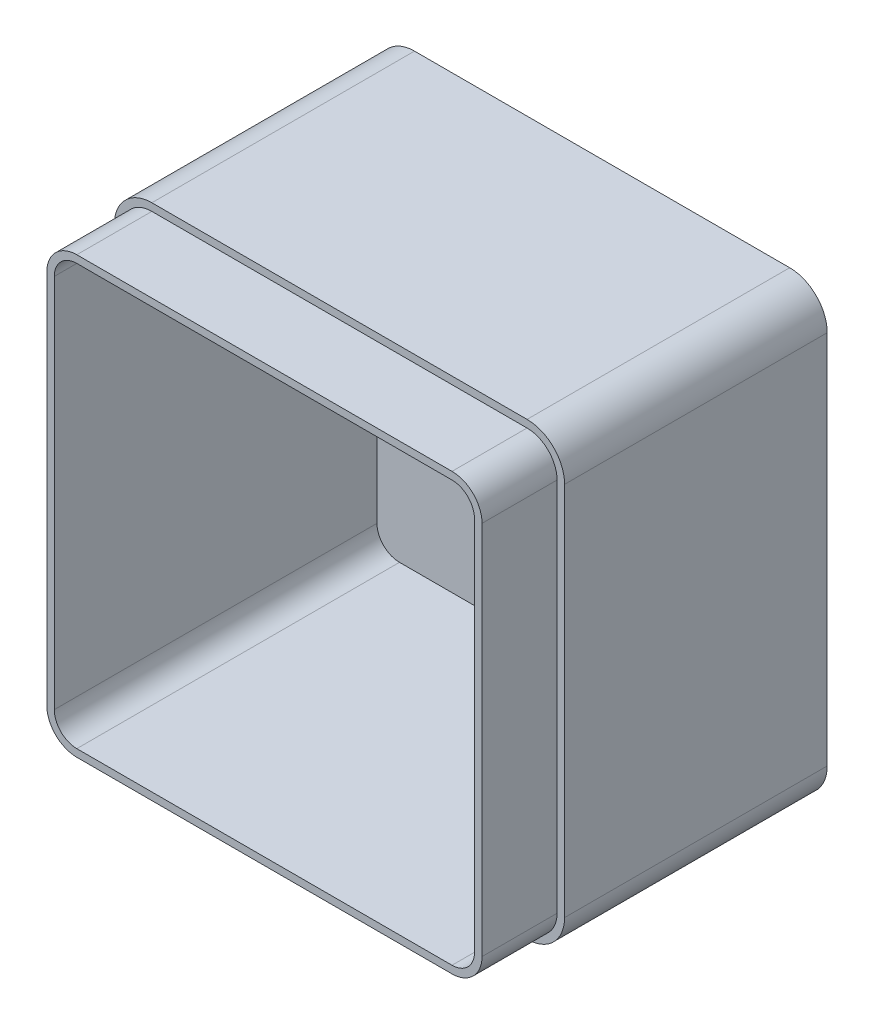
ISO-10303-21;
HEADER;
FILE_DESCRIPTION(('STEP AP214'),'2;1');
FILE_NAME('part.step','',(''),(''),'','','');
FILE_SCHEMA(('AUTOMOTIVE_DESIGN { 1 0 10303 214 1 1 1 1 }'));
ENDSEC;
DATA;
#1=APPLICATION_CONTEXT('core data for automotive mechanical design processes');
#2=APPLICATION_PROTOCOL_DEFINITION('international standard','automotive_design',2000,#1);
#3=PRODUCT_CONTEXT('',#1,'mechanical');
#4=PRODUCT('Part','Part','',(#3));
#5=PRODUCT_RELATED_PRODUCT_CATEGORY('part','',(#4));
#6=PRODUCT_DEFINITION_FORMATION('','',#4);
#7=PRODUCT_DEFINITION_CONTEXT('part definition',#1,'design');
#8=PRODUCT_DEFINITION('design','',#6,#7);
#9=PRODUCT_DEFINITION_SHAPE('','',#8);
#10=(LENGTH_UNIT() NAMED_UNIT(*) SI_UNIT(.MILLI.,.METRE.));
#11=(NAMED_UNIT(*) PLANE_ANGLE_UNIT() SI_UNIT($,.RADIAN.));
#12=(NAMED_UNIT(*) SI_UNIT($,.STERADIAN.) SOLID_ANGLE_UNIT());
#13=UNCERTAINTY_MEASURE_WITH_UNIT(LENGTH_MEASURE(1.E-05),#10,'distance_accuracy_value','');
#14=(GEOMETRIC_REPRESENTATION_CONTEXT(3) GLOBAL_UNCERTAINTY_ASSIGNED_CONTEXT((#13)) GLOBAL_UNIT_ASSIGNED_CONTEXT((#10,
#11,#12)) REPRESENTATION_CONTEXT('',''));
#15=CARTESIAN_POINT('',(0.,0.,0.));
#16=DIRECTION('',(0.,0.,1.));
#17=DIRECTION('',(1.,0.,0.));
#18=AXIS2_PLACEMENT_3D('',#15,#16,#17);
#19=CARTESIAN_POINT('',(0.,0.,90.));
#20=DIRECTION('',(0.,0.,-1.));
#21=DIRECTION('',(-1.,0.,0.));
#22=AXIS2_PLACEMENT_3D('',#19,#20,#21);
#23=PLANE('',#22);
#24=DIRECTION('',(1.,0.,0.));
#25=VECTOR('',#24,1.);
#26=CARTESIAN_POINT('',(0.,4.,90.));
#27=LINE('',#26,#25);
#28=CARTESIAN_POINT('',(9.99999999999999,4.,90.));
#29=VERTEX_POINT('',#28);
#30=CARTESIAN_POINT('',(110.,4.,90.));
#31=VERTEX_POINT('',#30);
#32=EDGE_CURVE('E330',#29,#31,#27,.T.);
#33=ORIENTED_EDGE('',*,*,#32,.F.);
#34=CARTESIAN_POINT('',(10.,10.,90.));
#35=DIRECTION('',(0.,0.,-1.));
#36=DIRECTION('',(-1.,0.,0.));
#37=AXIS2_PLACEMENT_3D('',#34,#35,#36);
#38=CIRCLE('',#37,6.);
#39=CARTESIAN_POINT('',(4.,9.99999999999999,90.));
#40=VERTEX_POINT('',#39);
#41=EDGE_CURVE('E331',#40,#29,#38,.F.);
#42=ORIENTED_EDGE('',*,*,#41,.F.);
#43=DIRECTION('',(0.,-1.,0.));
#44=VECTOR('',#43,1.);
#45=CARTESIAN_POINT('',(4.,0.,90.));
#46=LINE('',#45,#44);
#47=CARTESIAN_POINT('',(4.,110.,90.));
#48=VERTEX_POINT('',#47);
#49=EDGE_CURVE('E311',#48,#40,#46,.T.);
#50=ORIENTED_EDGE('',*,*,#49,.F.);
#51=CARTESIAN_POINT('',(10.,110.,90.));
#52=DIRECTION('',(0.,0.,-1.));
#53=DIRECTION('',(-1.,0.,0.));
#54=AXIS2_PLACEMENT_3D('',#51,#52,#53);
#55=CIRCLE('',#54,6.);
#56=CARTESIAN_POINT('',(9.99999999999999,116.,90.));
#57=VERTEX_POINT('',#56);
#58=EDGE_CURVE('E333',#57,#48,#55,.F.);
#59=ORIENTED_EDGE('',*,*,#58,.F.);
#60=DIRECTION('',(-1.,0.,0.));
#61=VECTOR('',#60,1.);
#62=CARTESIAN_POINT('',(0.,116.,90.));
#63=LINE('',#62,#61);
#64=CARTESIAN_POINT('',(110.,116.,90.));
#65=VERTEX_POINT('',#64);
#66=EDGE_CURVE('E323',#65,#57,#63,.T.);
#67=ORIENTED_EDGE('',*,*,#66,.F.);
#68=CARTESIAN_POINT('',(110.,110.,90.));
#69=DIRECTION('',(0.,0.,-1.));
#70=DIRECTION('',(-1.,0.,0.));
#71=AXIS2_PLACEMENT_3D('',#68,#69,#70);
#72=CIRCLE('',#71,6.);
#73=CARTESIAN_POINT('',(116.,110.,90.));
#74=VERTEX_POINT('',#73);
#75=EDGE_CURVE('E316',#74,#65,#72,.F.);
#76=ORIENTED_EDGE('',*,*,#75,.F.);
#77=DIRECTION('',(0.,1.,0.));
#78=VECTOR('',#77,1.);
#79=CARTESIAN_POINT('',(116.,0.,90.));
#80=LINE('',#79,#78);
#81=CARTESIAN_POINT('',(116.,9.99999999999999,90.));
#82=VERTEX_POINT('',#81);
#83=EDGE_CURVE('E336',#82,#74,#80,.T.);
#84=ORIENTED_EDGE('',*,*,#83,.F.);
#85=CARTESIAN_POINT('',(110.,10.,90.));
#86=DIRECTION('',(0.,0.,-1.));
#87=DIRECTION('',(-1.,0.,0.));
#88=AXIS2_PLACEMENT_3D('',#85,#86,#87);
#89=CIRCLE('',#88,6.);
#90=EDGE_CURVE('E294',#31,#82,#89,.F.);
#91=ORIENTED_EDGE('',*,*,#90,.F.);
#92=EDGE_LOOP('',(#33,#42,#50,#59,#67,#76,#84,#91));
#93=FACE_BOUND('',#92,.T.);
#94=CARTESIAN_POINT('',(10.,10.,90.));
#95=DIRECTION('',(0.,0.,1.));
#96=DIRECTION('',(1.,0.,0.));
#97=AXIS2_PLACEMENT_3D('',#94,#95,#96);
#98=CIRCLE('',#97,8.);
#99=CARTESIAN_POINT('',(2.,9.99999999999999,90.));
#100=VERTEX_POINT('',#99);
#101=CARTESIAN_POINT('',(9.99999999999999,2.,90.));
#102=VERTEX_POINT('',#101);
#103=EDGE_CURVE('E240',#100,#102,#98,.T.);
#104=ORIENTED_EDGE('',*,*,#103,.T.);
#105=DIRECTION('',(1.,0.,0.));
#106=VECTOR('',#105,1.);
#107=CARTESIAN_POINT('',(10.,2.,90.));
#108=LINE('',#107,#106);
#109=CARTESIAN_POINT('',(110.,2.,90.));
#110=VERTEX_POINT('',#109);
#111=EDGE_CURVE('E200',#102,#110,#108,.T.);
#112=ORIENTED_EDGE('',*,*,#111,.T.);
#113=CARTESIAN_POINT('',(110.,10.,90.));
#114=DIRECTION('',(0.,0.,1.));
#115=DIRECTION('',(1.,0.,0.));
#116=AXIS2_PLACEMENT_3D('',#113,#114,#115);
#117=CIRCLE('',#116,7.99999999999999);
#118=CARTESIAN_POINT('',(118.,10.,90.));
#119=VERTEX_POINT('',#118);
#120=EDGE_CURVE('E49',#110,#119,#117,.T.);
#121=ORIENTED_EDGE('',*,*,#120,.T.);
#122=DIRECTION('',(0.,1.,0.));
#123=VECTOR('',#122,1.);
#124=CARTESIAN_POINT('',(118.,10.,90.));
#125=LINE('',#124,#123);
#126=CARTESIAN_POINT('',(118.,110.,90.));
#127=VERTEX_POINT('',#126);
#128=EDGE_CURVE('E244',#119,#127,#125,.T.);
#129=ORIENTED_EDGE('',*,*,#128,.T.);
#130=CARTESIAN_POINT('',(110.,110.,90.));
#131=DIRECTION('',(0.,0.,1.));
#132=DIRECTION('',(1.,0.,0.));
#133=AXIS2_PLACEMENT_3D('',#130,#131,#132);
#134=CIRCLE('',#133,7.99999999999999);
#135=CARTESIAN_POINT('',(110.,118.,90.));
#136=VERTEX_POINT('',#135);
#137=EDGE_CURVE('E247',#127,#136,#134,.T.);
#138=ORIENTED_EDGE('',*,*,#137,.T.);
#139=DIRECTION('',(-1.,0.,0.));
#140=VECTOR('',#139,1.);
#141=CARTESIAN_POINT('',(110.,118.,90.));
#142=LINE('',#141,#140);
#143=CARTESIAN_POINT('',(9.99999999999999,118.,90.));
#144=VERTEX_POINT('',#143);
#145=EDGE_CURVE('E250',#136,#144,#142,.T.);
#146=ORIENTED_EDGE('',*,*,#145,.T.);
#147=CARTESIAN_POINT('',(10.,110.,90.));
#148=DIRECTION('',(0.,0.,1.));
#149=DIRECTION('',(1.,0.,0.));
#150=AXIS2_PLACEMENT_3D('',#147,#148,#149);
#151=CIRCLE('',#150,7.99999999999999);
#152=CARTESIAN_POINT('',(2.,110.,90.));
#153=VERTEX_POINT('',#152);
#154=EDGE_CURVE('E223',#144,#153,#151,.T.);
#155=ORIENTED_EDGE('',*,*,#154,.T.);
#156=DIRECTION('',(0.,-1.,0.));
#157=VECTOR('',#156,1.);
#158=CARTESIAN_POINT('',(2.,110.,90.));
#159=LINE('',#158,#157);
#160=EDGE_CURVE('E220',#153,#100,#159,.T.);
#161=ORIENTED_EDGE('',*,*,#160,.T.);
#162=EDGE_LOOP('',(#104,#112,#121,#129,#138,#146,#155,#161));
#163=FACE_BOUND('',#162,.T.);
#164=ADVANCED_FACE('F34',(#93,#163),#23,.F.);
#165=CARTESIAN_POINT('',(4.,0.,90.));
#166=DIRECTION('',(1.,0.,0.));
#167=DIRECTION('',(0.,0.,-1.));
#168=AXIS2_PLACEMENT_3D('',#165,#166,#167);
#169=PLANE('',#168);
#170=DIRECTION('',(0.,-1.,0.));
#171=VECTOR('',#170,1.);
#172=CARTESIAN_POINT('',(4.,0.,4.));
#173=LINE('',#172,#171);
#174=CARTESIAN_POINT('',(4.,110.,4.));
#175=VERTEX_POINT('',#174);
#176=CARTESIAN_POINT('',(4.,9.99999999999999,4.));
#177=VERTEX_POINT('',#176);
#178=EDGE_CURVE('E283',#175,#177,#173,.T.);
#179=ORIENTED_EDGE('',*,*,#178,.F.);
#180=DIRECTION('',(0.,0.,-1.));
#181=VECTOR('',#180,1.);
#182=CARTESIAN_POINT('',(4.,110.,90.));
#183=LINE('',#182,#181);
#184=EDGE_CURVE('E291',#48,#175,#183,.T.);
#185=ORIENTED_EDGE('',*,*,#184,.F.);
#186=ORIENTED_EDGE('',*,*,#49,.T.);
#187=DIRECTION('',(0.,0.,-1.));
#188=VECTOR('',#187,1.);
#189=CARTESIAN_POINT('',(4.,9.99999999999999,90.));
#190=LINE('',#189,#188);
#191=EDGE_CURVE('E287',#177,#40,#190,.F.);
#192=ORIENTED_EDGE('',*,*,#191,.F.);
#193=EDGE_LOOP('',(#179,#185,#186,#192));
#194=FACE_BOUND('',#193,.T.);
#195=ADVANCED_FACE('F428',(#194),#169,.T.);
#196=CARTESIAN_POINT('',(0.,4.,90.));
#197=DIRECTION('',(0.,1.,0.));
#198=DIRECTION('',(0.,0.,1.));
#199=AXIS2_PLACEMENT_3D('',#196,#197,#198);
#200=PLANE('',#199);
#201=DIRECTION('',(1.,0.,0.));
#202=VECTOR('',#201,1.);
#203=CARTESIAN_POINT('',(0.,4.,4.));
#204=LINE('',#203,#202);
#205=CARTESIAN_POINT('',(9.99999999999999,4.,4.));
#206=VERTEX_POINT('',#205);
#207=CARTESIAN_POINT('',(110.,4.,4.));
#208=VERTEX_POINT('',#207);
#209=EDGE_CURVE('E286',#206,#208,#204,.T.);
#210=ORIENTED_EDGE('',*,*,#209,.F.);
#211=DIRECTION('',(0.,0.,1.));
#212=VECTOR('',#211,1.);
#213=CARTESIAN_POINT('',(9.99999999999999,4.,90.));
#214=LINE('',#213,#212);
#215=EDGE_CURVE('E301',#29,#206,#214,.F.);
#216=ORIENTED_EDGE('',*,*,#215,.F.);
#217=ORIENTED_EDGE('',*,*,#32,.T.);
#218=DIRECTION('',(0.,0.,1.));
#219=VECTOR('',#218,1.);
#220=CARTESIAN_POINT('',(110.,4.,90.));
#221=LINE('',#220,#219);
#222=EDGE_CURVE('E314',#208,#31,#221,.T.);
#223=ORIENTED_EDGE('',*,*,#222,.F.);
#224=EDGE_LOOP('',(#210,#216,#217,#223));
#225=FACE_BOUND('',#224,.T.);
#226=ADVANCED_FACE('F434',(#225),#200,.T.);
#227=CARTESIAN_POINT('',(116.,0.,90.));
#228=DIRECTION('',(-1.,0.,0.));
#229=DIRECTION('',(0.,0.,1.));
#230=AXIS2_PLACEMENT_3D('',#227,#228,#229);
#231=PLANE('',#230);
#232=ORIENTED_EDGE('',*,*,#83,.T.);
#233=DIRECTION('',(0.,0.,1.));
#234=VECTOR('',#233,1.);
#235=CARTESIAN_POINT('',(116.,110.,90.));
#236=LINE('',#235,#234);
#237=CARTESIAN_POINT('',(116.,110.,4.));
#238=VERTEX_POINT('',#237);
#239=EDGE_CURVE('E321',#238,#74,#236,.T.);
#240=ORIENTED_EDGE('',*,*,#239,.F.);
#241=DIRECTION('',(0.,1.,0.));
#242=VECTOR('',#241,1.);
#243=CARTESIAN_POINT('',(116.,0.,4.));
#244=LINE('',#243,#242);
#245=CARTESIAN_POINT('',(116.,9.99999999999999,4.));
#246=VERTEX_POINT('',#245);
#247=EDGE_CURVE('E295',#246,#238,#244,.T.);
#248=ORIENTED_EDGE('',*,*,#247,.F.);
#249=DIRECTION('',(0.,0.,1.));
#250=VECTOR('',#249,1.);
#251=CARTESIAN_POINT('',(116.,9.99999999999999,90.));
#252=LINE('',#251,#250);
#253=EDGE_CURVE('E313',#82,#246,#252,.F.);
#254=ORIENTED_EDGE('',*,*,#253,.F.);
#255=EDGE_LOOP('',(#232,#240,#248,#254));
#256=FACE_BOUND('',#255,.T.);
#257=ADVANCED_FACE('F463',(#256),#231,.T.);
#258=CARTESIAN_POINT('',(0.,116.,90.));
#259=DIRECTION('',(0.,-1.,0.));
#260=DIRECTION('',(0.,0.,-1.));
#261=AXIS2_PLACEMENT_3D('',#258,#259,#260);
#262=PLANE('',#261);
#263=DIRECTION('',(-1.,0.,0.));
#264=VECTOR('',#263,1.);
#265=CARTESIAN_POINT('',(0.,116.,4.));
#266=LINE('',#265,#264);
#267=CARTESIAN_POINT('',(110.,116.,4.));
#268=VERTEX_POINT('',#267);
#269=CARTESIAN_POINT('',(9.99999999999999,116.,4.));
#270=VERTEX_POINT('',#269);
#271=EDGE_CURVE('E298',#268,#270,#266,.T.);
#272=ORIENTED_EDGE('',*,*,#271,.F.);
#273=DIRECTION('',(0.,0.,-1.));
#274=VECTOR('',#273,1.);
#275=CARTESIAN_POINT('',(110.,116.,90.));
#276=LINE('',#275,#274);
#277=EDGE_CURVE('E290',#65,#268,#276,.T.);
#278=ORIENTED_EDGE('',*,*,#277,.F.);
#279=ORIENTED_EDGE('',*,*,#66,.T.);
#280=DIRECTION('',(0.,0.,-1.));
#281=VECTOR('',#280,1.);
#282=CARTESIAN_POINT('',(9.99999999999999,116.,90.));
#283=LINE('',#282,#281);
#284=EDGE_CURVE('E326',#270,#57,#283,.F.);
#285=ORIENTED_EDGE('',*,*,#284,.F.);
#286=EDGE_LOOP('',(#272,#278,#279,#285));
#287=FACE_BOUND('',#286,.T.);
#288=ADVANCED_FACE('F459',(#287),#262,.T.);
#289=CARTESIAN_POINT('',(0.,0.,4.));
#290=DIRECTION('',(0.,0.,-1.));
#291=DIRECTION('',(-1.,0.,0.));
#292=AXIS2_PLACEMENT_3D('',#289,#290,#291);
#293=PLANE('',#292);
#294=ORIENTED_EDGE('',*,*,#247,.T.);
#295=CARTESIAN_POINT('',(110.,110.,4.));
#296=DIRECTION('',(0.,0.,-1.));
#297=DIRECTION('',(-1.,0.,0.));
#298=AXIS2_PLACEMENT_3D('',#295,#296,#297);
#299=CIRCLE('',#298,6.);
#300=EDGE_CURVE('E308',#268,#238,#299,.T.);
#301=ORIENTED_EDGE('',*,*,#300,.F.);
#302=ORIENTED_EDGE('',*,*,#271,.T.);
#303=CARTESIAN_POINT('',(10.,110.,4.));
#304=DIRECTION('',(0.,0.,-1.));
#305=DIRECTION('',(-1.,0.,0.));
#306=AXIS2_PLACEMENT_3D('',#303,#304,#305);
#307=CIRCLE('',#306,6.);
#308=EDGE_CURVE('E306',#175,#270,#307,.T.);
#309=ORIENTED_EDGE('',*,*,#308,.F.);
#310=ORIENTED_EDGE('',*,*,#178,.T.);
#311=CARTESIAN_POINT('',(10.,10.,4.));
#312=DIRECTION('',(0.,0.,-1.));
#313=DIRECTION('',(-1.,0.,0.));
#314=AXIS2_PLACEMENT_3D('',#311,#312,#313);
#315=CIRCLE('',#314,6.);
#316=EDGE_CURVE('E302',#206,#177,#315,.T.);
#317=ORIENTED_EDGE('',*,*,#316,.F.);
#318=ORIENTED_EDGE('',*,*,#209,.T.);
#319=CARTESIAN_POINT('',(110.,10.,4.));
#320=DIRECTION('',(0.,0.,-1.));
#321=DIRECTION('',(-1.,0.,0.));
#322=AXIS2_PLACEMENT_3D('',#319,#320,#321);
#323=CIRCLE('',#322,6.);
#324=EDGE_CURVE('E299',#246,#208,#323,.T.);
#325=ORIENTED_EDGE('',*,*,#324,.F.);
#326=EDGE_LOOP('',(#294,#301,#302,#309,#310,#317,#318,#325));
#327=FACE_BOUND('',#326,.T.);
#328=ADVANCED_FACE('F455',(#327),#293,.F.);
#329=CARTESIAN_POINT('',(110.,10.,90.));
#330=DIRECTION('',(0.,0.,-1.));
#331=DIRECTION('',(-1.,0.,0.));
#332=AXIS2_PLACEMENT_3D('',#329,#330,#331);
#333=CYLINDRICAL_SURFACE('',#332,6.);
#334=ORIENTED_EDGE('',*,*,#90,.T.);
#335=ORIENTED_EDGE('',*,*,#253,.T.);
#336=ORIENTED_EDGE('',*,*,#324,.T.);
#337=ORIENTED_EDGE('',*,*,#222,.T.);
#338=EDGE_LOOP('',(#334,#335,#336,#337));
#339=FACE_BOUND('',#338,.T.);
#340=ADVANCED_FACE('F451',(#339),#333,.F.);
#341=CARTESIAN_POINT('',(10.,10.,90.));
#342=DIRECTION('',(0.,0.,-1.));
#343=DIRECTION('',(-1.,0.,0.));
#344=AXIS2_PLACEMENT_3D('',#341,#342,#343);
#345=CYLINDRICAL_SURFACE('',#344,6.);
#346=ORIENTED_EDGE('',*,*,#41,.T.);
#347=ORIENTED_EDGE('',*,*,#215,.T.);
#348=ORIENTED_EDGE('',*,*,#316,.T.);
#349=ORIENTED_EDGE('',*,*,#191,.T.);
#350=EDGE_LOOP('',(#346,#347,#348,#349));
#351=FACE_BOUND('',#350,.T.);
#352=ADVANCED_FACE('F447',(#351),#345,.F.);
#353=CARTESIAN_POINT('',(10.,110.,90.));
#354=DIRECTION('',(0.,0.,-1.));
#355=DIRECTION('',(-1.,0.,0.));
#356=AXIS2_PLACEMENT_3D('',#353,#354,#355);
#357=CYLINDRICAL_SURFACE('',#356,6.);
#358=ORIENTED_EDGE('',*,*,#58,.T.);
#359=ORIENTED_EDGE('',*,*,#184,.T.);
#360=ORIENTED_EDGE('',*,*,#308,.T.);
#361=ORIENTED_EDGE('',*,*,#284,.T.);
#362=EDGE_LOOP('',(#358,#359,#360,#361));
#363=FACE_BOUND('',#362,.T.);
#364=ADVANCED_FACE('F443',(#363),#357,.F.);
#365=CARTESIAN_POINT('',(110.,110.,90.));
#366=DIRECTION('',(0.,0.,-1.));
#367=DIRECTION('',(-1.,0.,0.));
#368=AXIS2_PLACEMENT_3D('',#365,#366,#367);
#369=CYLINDRICAL_SURFACE('',#368,6.);
#370=ORIENTED_EDGE('',*,*,#75,.T.);
#371=ORIENTED_EDGE('',*,*,#277,.T.);
#372=ORIENTED_EDGE('',*,*,#300,.T.);
#373=ORIENTED_EDGE('',*,*,#239,.T.);
#374=EDGE_LOOP('',(#370,#371,#372,#373));
#375=FACE_BOUND('',#374,.T.);
#376=ADVANCED_FACE('F440',(#375),#369,.F.);
#377=CARTESIAN_POINT('',(60.,60.,70.));
#378=DIRECTION('',(0.,0.,1.));
#379=DIRECTION('',(1.,0.,0.));
#380=AXIS2_PLACEMENT_3D('',#377,#378,#379);
#381=PLANE('',#380);
#382=DIRECTION('',(1.,0.,0.));
#383=VECTOR('',#382,1.);
#384=CARTESIAN_POINT('',(0.,0.,70.));
#385=LINE('',#384,#383);
#386=CARTESIAN_POINT('',(10.,0.,70.));
#387=VERTEX_POINT('',#386);
#388=CARTESIAN_POINT('',(110.,0.,70.));
#389=VERTEX_POINT('',#388);
#390=EDGE_CURVE('E276',#387,#389,#385,.T.);
#391=ORIENTED_EDGE('',*,*,#390,.T.);
#392=CARTESIAN_POINT('',(110.,10.,70.));
#393=DIRECTION('',(0.,0.,1.));
#394=DIRECTION('',(1.,0.,0.));
#395=AXIS2_PLACEMENT_3D('',#392,#393,#394);
#396=CIRCLE('',#395,10.);
#397=CARTESIAN_POINT('',(120.,9.99999999999999,70.));
#398=VERTEX_POINT('',#397);
#399=EDGE_CURVE('E273',#398,#389,#396,.F.);
#400=ORIENTED_EDGE('',*,*,#399,.F.);
#401=DIRECTION('',(0.,1.,0.));
#402=VECTOR('',#401,1.);
#403=CARTESIAN_POINT('',(120.,0.,70.));
#404=LINE('',#403,#402);
#405=CARTESIAN_POINT('',(120.,110.,70.));
#406=VERTEX_POINT('',#405);
#407=EDGE_CURVE('E57',#398,#406,#404,.T.);
#408=ORIENTED_EDGE('',*,*,#407,.T.);
#409=CARTESIAN_POINT('',(110.,110.,70.));
#410=DIRECTION('',(0.,0.,1.));
#411=DIRECTION('',(1.,0.,0.));
#412=AXIS2_PLACEMENT_3D('',#409,#410,#411);
#413=CIRCLE('',#412,10.);
#414=CARTESIAN_POINT('',(110.,120.,70.));
#415=VERTEX_POINT('',#414);
#416=EDGE_CURVE('E12',#415,#406,#413,.F.);
#417=ORIENTED_EDGE('',*,*,#416,.F.);
#418=DIRECTION('',(-1.,0.,0.));
#419=VECTOR('',#418,1.);
#420=CARTESIAN_POINT('',(0.,120.,70.));
#421=LINE('',#420,#419);
#422=CARTESIAN_POINT('',(10.,120.,70.));
#423=VERTEX_POINT('',#422);
#424=EDGE_CURVE('E256',#415,#423,#421,.T.);
#425=ORIENTED_EDGE('',*,*,#424,.T.);
#426=CARTESIAN_POINT('',(10.,110.,70.));
#427=DIRECTION('',(0.,0.,1.));
#428=DIRECTION('',(1.,0.,0.));
#429=AXIS2_PLACEMENT_3D('',#426,#427,#428);
#430=CIRCLE('',#429,10.);
#431=CARTESIAN_POINT('',(0.,110.,70.));
#432=VERTEX_POINT('',#431);
#433=EDGE_CURVE('E270',#432,#423,#430,.F.);
#434=ORIENTED_EDGE('',*,*,#433,.F.);
#435=DIRECTION('',(0.,-1.,0.));
#436=VECTOR('',#435,1.);
#437=CARTESIAN_POINT('',(0.,0.,70.));
#438=LINE('',#437,#436);
#439=CARTESIAN_POINT('',(0.,9.99999999999999,70.));
#440=VERTEX_POINT('',#439);
#441=EDGE_CURVE('E278',#432,#440,#438,.T.);
#442=ORIENTED_EDGE('',*,*,#441,.T.);
#443=CARTESIAN_POINT('',(10.,10.,70.));
#444=DIRECTION('',(0.,0.,1.));
#445=DIRECTION('',(1.,0.,0.));
#446=AXIS2_PLACEMENT_3D('',#443,#444,#445);
#447=CIRCLE('',#446,10.);
#448=EDGE_CURVE('E280',#387,#440,#447,.F.);
#449=ORIENTED_EDGE('',*,*,#448,.F.);
#450=EDGE_LOOP('',(#391,#400,#408,#417,#425,#434,#442,#449));
#451=FACE_BOUND('',#450,.T.);
#452=DIRECTION('',(0.,-1.,0.));
#453=VECTOR('',#452,1.);
#454=CARTESIAN_POINT('',(2.,110.,70.));
#455=LINE('',#454,#453);
#456=CARTESIAN_POINT('',(2.,110.,70.));
#457=VERTEX_POINT('',#456);
#458=CARTESIAN_POINT('',(2.,9.99999999999999,70.));
#459=VERTEX_POINT('',#458);
#460=EDGE_CURVE('E206',#457,#459,#455,.T.);
#461=ORIENTED_EDGE('',*,*,#460,.F.);
#462=CARTESIAN_POINT('',(10.,110.,70.));
#463=DIRECTION('',(0.,0.,1.));
#464=DIRECTION('',(1.,0.,0.));
#465=AXIS2_PLACEMENT_3D('',#462,#463,#464);
#466=CIRCLE('',#465,7.99999999999999);
#467=CARTESIAN_POINT('',(9.99999999999999,118.,70.));
#468=VERTEX_POINT('',#467);
#469=EDGE_CURVE('E236',#468,#457,#466,.T.);
#470=ORIENTED_EDGE('',*,*,#469,.F.);
#471=DIRECTION('',(-1.,0.,0.));
#472=VECTOR('',#471,1.);
#473=CARTESIAN_POINT('',(110.,118.,70.));
#474=LINE('',#473,#472);
#475=CARTESIAN_POINT('',(110.,118.,70.));
#476=VERTEX_POINT('',#475);
#477=EDGE_CURVE('E233',#476,#468,#474,.T.);
#478=ORIENTED_EDGE('',*,*,#477,.F.);
#479=CARTESIAN_POINT('',(110.,110.,70.));
#480=DIRECTION('',(0.,0.,1.));
#481=DIRECTION('',(1.,0.,0.));
#482=AXIS2_PLACEMENT_3D('',#479,#480,#481);
#483=CIRCLE('',#482,7.99999999999999);
#484=CARTESIAN_POINT('',(118.,110.,70.));
#485=VERTEX_POINT('',#484);
#486=EDGE_CURVE('E230',#485,#476,#483,.T.);
#487=ORIENTED_EDGE('',*,*,#486,.F.);
#488=DIRECTION('',(0.,1.,0.));
#489=VECTOR('',#488,1.);
#490=CARTESIAN_POINT('',(118.,10.,70.));
#491=LINE('',#490,#489);
#492=CARTESIAN_POINT('',(118.,10.,70.));
#493=VERTEX_POINT('',#492);
#494=EDGE_CURVE('E227',#493,#485,#491,.T.);
#495=ORIENTED_EDGE('',*,*,#494,.F.);
#496=CARTESIAN_POINT('',(110.,10.,70.));
#497=DIRECTION('',(0.,0.,1.));
#498=DIRECTION('',(1.,0.,0.));
#499=AXIS2_PLACEMENT_3D('',#496,#497,#498);
#500=CIRCLE('',#499,7.99999999999999);
#501=CARTESIAN_POINT('',(110.,2.,70.));
#502=VERTEX_POINT('',#501);
#503=EDGE_CURVE('E216',#502,#493,#500,.T.);
#504=ORIENTED_EDGE('',*,*,#503,.F.);
#505=DIRECTION('',(1.,0.,0.));
#506=VECTOR('',#505,1.);
#507=CARTESIAN_POINT('',(10.,2.,70.));
#508=LINE('',#507,#506);
#509=CARTESIAN_POINT('',(10.,2.,70.));
#510=VERTEX_POINT('',#509);
#511=EDGE_CURVE('E198',#510,#502,#508,.T.);
#512=ORIENTED_EDGE('',*,*,#511,.F.);
#513=CARTESIAN_POINT('',(10.,10.,70.));
#514=DIRECTION('',(0.,0.,1.));
#515=DIRECTION('',(1.,0.,0.));
#516=AXIS2_PLACEMENT_3D('',#513,#514,#515);
#517=CIRCLE('',#516,8.);
#518=EDGE_CURVE('E212',#459,#510,#517,.T.);
#519=ORIENTED_EDGE('',*,*,#518,.F.);
#520=EDGE_LOOP('',(#461,#470,#478,#487,#495,#504,#512,#519));
#521=FACE_BOUND('',#520,.T.);
#522=ADVANCED_FACE('F211',(#451,#521),#381,.T.);
#523=CARTESIAN_POINT('',(10.,10.,70.));
#524=DIRECTION('',(0.,0.,1.));
#525=DIRECTION('',(1.,0.,0.));
#526=AXIS2_PLACEMENT_3D('',#523,#524,#525);
#527=CYLINDRICAL_SURFACE('',#526,8.);
#528=ORIENTED_EDGE('',*,*,#103,.F.);
#529=DIRECTION('',(0.,0.,1.));
#530=VECTOR('',#529,1.);
#531=CARTESIAN_POINT('',(2.,9.99999999999999,70.));
#532=LINE('',#531,#530);
#533=EDGE_CURVE('E219',#459,#100,#532,.T.);
#534=ORIENTED_EDGE('',*,*,#533,.F.);
#535=ORIENTED_EDGE('',*,*,#518,.T.);
#536=DIRECTION('',(0.,0.,1.));
#537=VECTOR('',#536,1.);
#538=CARTESIAN_POINT('',(10.,2.,70.));
#539=LINE('',#538,#537);
#540=EDGE_CURVE('E195',#510,#102,#539,.T.);
#541=ORIENTED_EDGE('',*,*,#540,.T.);
#542=EDGE_LOOP('',(#528,#534,#535,#541));
#543=FACE_BOUND('',#542,.T.);
#544=ADVANCED_FACE('F218',(#543),#527,.T.);
#545=CARTESIAN_POINT('',(2.,110.,70.));
#546=DIRECTION('',(-1.,0.,0.));
#547=DIRECTION('',(0.,-1.,0.));
#548=AXIS2_PLACEMENT_3D('',#545,#546,#547);
#549=PLANE('',#548);
#550=ORIENTED_EDGE('',*,*,#160,.F.);
#551=DIRECTION('',(0.,0.,1.));
#552=VECTOR('',#551,1.);
#553=CARTESIAN_POINT('',(2.,110.,70.));
#554=LINE('',#553,#552);
#555=EDGE_CURVE('E257',#457,#153,#554,.T.);
#556=ORIENTED_EDGE('',*,*,#555,.F.);
#557=ORIENTED_EDGE('',*,*,#460,.T.);
#558=ORIENTED_EDGE('',*,*,#533,.T.);
#559=EDGE_LOOP('',(#550,#556,#557,#558));
#560=FACE_BOUND('',#559,.T.);
#561=ADVANCED_FACE('F474',(#560),#549,.T.);
#562=CARTESIAN_POINT('',(10.,110.,70.));
#563=DIRECTION('',(0.,0.,1.));
#564=DIRECTION('',(1.,0.,0.));
#565=AXIS2_PLACEMENT_3D('',#562,#563,#564);
#566=CYLINDRICAL_SURFACE('',#565,7.99999999999999);
#567=ORIENTED_EDGE('',*,*,#154,.F.);
#568=DIRECTION('',(0.,0.,1.));
#569=VECTOR('',#568,1.);
#570=CARTESIAN_POINT('',(9.99999999999999,118.,70.));
#571=LINE('',#570,#569);
#572=EDGE_CURVE('E259',#468,#144,#571,.T.);
#573=ORIENTED_EDGE('',*,*,#572,.F.);
#574=ORIENTED_EDGE('',*,*,#469,.T.);
#575=ORIENTED_EDGE('',*,*,#555,.T.);
#576=EDGE_LOOP('',(#567,#573,#574,#575));
#577=FACE_BOUND('',#576,.T.);
#578=ADVANCED_FACE('F489',(#577),#566,.T.);
#579=CARTESIAN_POINT('',(110.,118.,70.));
#580=DIRECTION('',(0.,1.,0.));
#581=DIRECTION('',(0.,0.,1.));
#582=AXIS2_PLACEMENT_3D('',#579,#580,#581);
#583=PLANE('',#582);
#584=ORIENTED_EDGE('',*,*,#145,.F.);
#585=DIRECTION('',(0.,0.,1.));
#586=VECTOR('',#585,1.);
#587=CARTESIAN_POINT('',(110.,118.,70.));
#588=LINE('',#587,#586);
#589=EDGE_CURVE('E261',#476,#136,#588,.T.);
#590=ORIENTED_EDGE('',*,*,#589,.F.);
#591=ORIENTED_EDGE('',*,*,#477,.T.);
#592=ORIENTED_EDGE('',*,*,#572,.T.);
#593=EDGE_LOOP('',(#584,#590,#591,#592));
#594=FACE_BOUND('',#593,.T.);
#595=ADVANCED_FACE('F485',(#594),#583,.T.);
#596=CARTESIAN_POINT('',(110.,110.,70.));
#597=DIRECTION('',(0.,0.,1.));
#598=DIRECTION('',(1.,0.,0.));
#599=AXIS2_PLACEMENT_3D('',#596,#597,#598);
#600=CYLINDRICAL_SURFACE('',#599,7.99999999999999);
#601=ORIENTED_EDGE('',*,*,#137,.F.);
#602=DIRECTION('',(0.,0.,1.));
#603=VECTOR('',#602,1.);
#604=CARTESIAN_POINT('',(118.,110.,70.));
#605=LINE('',#604,#603);
#606=EDGE_CURVE('E263',#485,#127,#605,.T.);
#607=ORIENTED_EDGE('',*,*,#606,.F.);
#608=ORIENTED_EDGE('',*,*,#486,.T.);
#609=ORIENTED_EDGE('',*,*,#589,.T.);
#610=EDGE_LOOP('',(#601,#607,#608,#609));
#611=FACE_BOUND('',#610,.T.);
#612=ADVANCED_FACE('F481',(#611),#600,.T.);
#613=CARTESIAN_POINT('',(118.,10.,70.));
#614=DIRECTION('',(1.,0.,0.));
#615=DIRECTION('',(0.,0.,-1.));
#616=AXIS2_PLACEMENT_3D('',#613,#614,#615);
#617=PLANE('',#616);
#618=ORIENTED_EDGE('',*,*,#128,.F.);
#619=DIRECTION('',(0.,0.,1.));
#620=VECTOR('',#619,1.);
#621=CARTESIAN_POINT('',(118.,10.,70.));
#622=LINE('',#621,#620);
#623=EDGE_CURVE('E265',#493,#119,#622,.T.);
#624=ORIENTED_EDGE('',*,*,#623,.F.);
#625=ORIENTED_EDGE('',*,*,#494,.T.);
#626=ORIENTED_EDGE('',*,*,#606,.T.);
#627=EDGE_LOOP('',(#618,#624,#625,#626));
#628=FACE_BOUND('',#627,.T.);
#629=ADVANCED_FACE('F478',(#628),#617,.T.);
#630=CARTESIAN_POINT('',(110.,10.,70.));
#631=DIRECTION('',(0.,0.,1.));
#632=DIRECTION('',(1.,0.,0.));
#633=AXIS2_PLACEMENT_3D('',#630,#631,#632);
#634=CYLINDRICAL_SURFACE('',#633,7.99999999999999);
#635=ORIENTED_EDGE('',*,*,#120,.F.);
#636=DIRECTION('',(0.,0.,1.));
#637=VECTOR('',#636,1.);
#638=CARTESIAN_POINT('',(110.,2.,70.));
#639=LINE('',#638,#637);
#640=EDGE_CURVE('E205',#502,#110,#639,.T.);
#641=ORIENTED_EDGE('',*,*,#640,.F.);
#642=ORIENTED_EDGE('',*,*,#503,.T.);
#643=ORIENTED_EDGE('',*,*,#623,.T.);
#644=EDGE_LOOP('',(#635,#641,#642,#643));
#645=FACE_BOUND('',#644,.T.);
#646=ADVANCED_FACE('F423',(#645),#634,.T.);
#647=CARTESIAN_POINT('',(10.,2.,70.));
#648=DIRECTION('',(0.,-1.,0.));
#649=DIRECTION('',(0.,0.,-1.));
#650=AXIS2_PLACEMENT_3D('',#647,#648,#649);
#651=PLANE('',#650);
#652=ORIENTED_EDGE('',*,*,#111,.F.);
#653=ORIENTED_EDGE('',*,*,#540,.F.);
#654=ORIENTED_EDGE('',*,*,#511,.T.);
#655=ORIENTED_EDGE('',*,*,#640,.T.);
#656=EDGE_LOOP('',(#652,#653,#654,#655));
#657=FACE_BOUND('',#656,.T.);
#658=ADVANCED_FACE('F197',(#657),#651,.T.);
#659=CARTESIAN_POINT('',(0.,0.,0.));
#660=DIRECTION('',(0.,0.,-1.));
#661=DIRECTION('',(-1.,0.,0.));
#662=AXIS2_PLACEMENT_3D('',#659,#660,#661);
#663=PLANE('',#662);
#664=DIRECTION('',(0.,1.,0.));
#665=VECTOR('',#664,1.);
#666=CARTESIAN_POINT('',(120.,0.,0.));
#667=LINE('',#666,#665);
#668=CARTESIAN_POINT('',(120.,9.99999999999999,0.));
#669=VERTEX_POINT('',#668);
#670=CARTESIAN_POINT('',(120.,110.,0.));
#671=VERTEX_POINT('',#670);
#672=EDGE_CURVE('E349',#669,#671,#667,.T.);
#673=ORIENTED_EDGE('',*,*,#672,.F.);
#674=CARTESIAN_POINT('',(110.,10.,0.));
#675=DIRECTION('',(0.,0.,-1.));
#676=DIRECTION('',(-1.,0.,0.));
#677=AXIS2_PLACEMENT_3D('',#674,#675,#676);
#678=CIRCLE('',#677,10.);
#679=CARTESIAN_POINT('',(110.,0.,0.));
#680=VERTEX_POINT('',#679);
#681=EDGE_CURVE('E366',#669,#680,#678,.T.);
#682=ORIENTED_EDGE('',*,*,#681,.T.);
#683=DIRECTION('',(1.,0.,0.));
#684=VECTOR('',#683,1.);
#685=CARTESIAN_POINT('',(0.,0.,0.));
#686=LINE('',#685,#684);
#687=CARTESIAN_POINT('',(10.,0.,0.));
#688=VERTEX_POINT('',#687);
#689=EDGE_CURVE('E346',#688,#680,#686,.T.);
#690=ORIENTED_EDGE('',*,*,#689,.F.);
#691=CARTESIAN_POINT('',(10.,10.,0.));
#692=DIRECTION('',(0.,0.,-1.));
#693=DIRECTION('',(-1.,0.,0.));
#694=AXIS2_PLACEMENT_3D('',#691,#692,#693);
#695=CIRCLE('',#694,10.);
#696=CARTESIAN_POINT('',(0.,9.99999999999999,0.));
#697=VERTEX_POINT('',#696);
#698=EDGE_CURVE('E364',#688,#697,#695,.T.);
#699=ORIENTED_EDGE('',*,*,#698,.T.);
#700=DIRECTION('',(0.,-1.,0.));
#701=VECTOR('',#700,1.);
#702=CARTESIAN_POINT('',(0.,0.,0.));
#703=LINE('',#702,#701);
#704=CARTESIAN_POINT('',(0.,110.,0.));
#705=VERTEX_POINT('',#704);
#706=EDGE_CURVE('E328',#705,#697,#703,.T.);
#707=ORIENTED_EDGE('',*,*,#706,.F.);
#708=CARTESIAN_POINT('',(10.,110.,0.));
#709=DIRECTION('',(0.,0.,-1.));
#710=DIRECTION('',(-1.,0.,0.));
#711=AXIS2_PLACEMENT_3D('',#708,#709,#710);
#712=CIRCLE('',#711,10.);
#713=CARTESIAN_POINT('',(10.,120.,0.));
#714=VERTEX_POINT('',#713);
#715=EDGE_CURVE('E362',#705,#714,#712,.T.);
#716=ORIENTED_EDGE('',*,*,#715,.T.);
#717=DIRECTION('',(-1.,0.,0.));
#718=VECTOR('',#717,1.);
#719=CARTESIAN_POINT('',(0.,120.,0.));
#720=LINE('',#719,#718);
#721=CARTESIAN_POINT('',(110.,120.,0.));
#722=VERTEX_POINT('',#721);
#723=EDGE_CURVE('E352',#722,#714,#720,.T.);
#724=ORIENTED_EDGE('',*,*,#723,.F.);
#725=CARTESIAN_POINT('',(110.,110.,0.));
#726=DIRECTION('',(0.,0.,-1.));
#727=DIRECTION('',(-1.,0.,0.));
#728=AXIS2_PLACEMENT_3D('',#725,#726,#727);
#729=CIRCLE('',#728,10.);
#730=EDGE_CURVE('E360',#722,#671,#729,.T.);
#731=ORIENTED_EDGE('',*,*,#730,.T.);
#732=EDGE_LOOP('',(#673,#682,#690,#699,#707,#716,#724,#731));
#733=FACE_BOUND('',#732,.T.);
#734=ADVANCED_FACE('F415',(#733),#663,.T.);
#735=CARTESIAN_POINT('',(10.,110.,90.));
#736=DIRECTION('',(0.,0.,-1.));
#737=DIRECTION('',(-1.,0.,0.));
#738=AXIS2_PLACEMENT_3D('',#735,#736,#737);
#739=CYLINDRICAL_SURFACE('',#738,10.);
#740=DIRECTION('',(0.,0.,-1.));
#741=VECTOR('',#740,1.);
#742=CARTESIAN_POINT('',(0.,110.,90.));
#743=LINE('',#742,#741);
#744=EDGE_CURVE('E373',#432,#705,#743,.T.);
#745=ORIENTED_EDGE('',*,*,#744,.F.);
#746=ORIENTED_EDGE('',*,*,#433,.T.);
#747=DIRECTION('',(0.,0.,-1.));
#748=VECTOR('',#747,1.);
#749=CARTESIAN_POINT('',(10.,120.,90.));
#750=LINE('',#749,#748);
#751=EDGE_CURVE('E42',#714,#423,#750,.F.);
#752=ORIENTED_EDGE('',*,*,#751,.F.);
#753=ORIENTED_EDGE('',*,*,#715,.F.);
#754=EDGE_LOOP('',(#745,#746,#752,#753));
#755=FACE_BOUND('',#754,.T.);
#756=ADVANCED_FACE('F389',(#755),#739,.T.);
#757=CARTESIAN_POINT('',(110.,110.,90.));
#758=DIRECTION('',(0.,0.,-1.));
#759=DIRECTION('',(-1.,0.,0.));
#760=AXIS2_PLACEMENT_3D('',#757,#758,#759);
#761=CYLINDRICAL_SURFACE('',#760,10.);
#762=DIRECTION('',(0.,0.,-1.));
#763=VECTOR('',#762,1.);
#764=CARTESIAN_POINT('',(110.,120.,90.));
#765=LINE('',#764,#763);
#766=EDGE_CURVE('E378',#415,#722,#765,.T.);
#767=ORIENTED_EDGE('',*,*,#766,.F.);
#768=ORIENTED_EDGE('',*,*,#416,.T.);
#769=DIRECTION('',(0.,0.,-1.));
#770=VECTOR('',#769,1.);
#771=CARTESIAN_POINT('',(120.,110.,90.));
#772=LINE('',#771,#770);
#773=EDGE_CURVE('E355',#671,#406,#772,.F.);
#774=ORIENTED_EDGE('',*,*,#773,.F.);
#775=ORIENTED_EDGE('',*,*,#730,.F.);
#776=EDGE_LOOP('',(#767,#768,#774,#775));
#777=FACE_BOUND('',#776,.T.);
#778=ADVANCED_FACE('F36',(#777),#761,.T.);
#779=CARTESIAN_POINT('',(0.,120.,90.));
#780=DIRECTION('',(0.,-1.,0.));
#781=DIRECTION('',(0.,0.,-1.));
#782=AXIS2_PLACEMENT_3D('',#779,#780,#781);
#783=PLANE('',#782);
#784=ORIENTED_EDGE('',*,*,#424,.F.);
#785=ORIENTED_EDGE('',*,*,#766,.T.);
#786=ORIENTED_EDGE('',*,*,#723,.T.);
#787=ORIENTED_EDGE('',*,*,#751,.T.);
#788=EDGE_LOOP('',(#784,#785,#786,#787));
#789=FACE_BOUND('',#788,.T.);
#790=ADVANCED_FACE('F383',(#789),#783,.F.);
#791=CARTESIAN_POINT('',(110.,10.,90.));
#792=DIRECTION('',(0.,0.,-1.));
#793=DIRECTION('',(-1.,0.,0.));
#794=AXIS2_PLACEMENT_3D('',#791,#792,#793);
#795=CYLINDRICAL_SURFACE('',#794,10.);
#796=DIRECTION('',(0.,0.,-1.));
#797=VECTOR('',#796,1.);
#798=CARTESIAN_POINT('',(120.,10.,90.));
#799=LINE('',#798,#797);
#800=EDGE_CURVE('E358',#398,#669,#799,.T.);
#801=ORIENTED_EDGE('',*,*,#800,.F.);
#802=ORIENTED_EDGE('',*,*,#399,.T.);
#803=DIRECTION('',(0.,0.,-1.));
#804=VECTOR('',#803,1.);
#805=CARTESIAN_POINT('',(110.,0.,90.));
#806=LINE('',#805,#804);
#807=EDGE_CURVE('E370',#680,#389,#806,.F.);
#808=ORIENTED_EDGE('',*,*,#807,.F.);
#809=ORIENTED_EDGE('',*,*,#681,.F.);
#810=EDGE_LOOP('',(#801,#802,#808,#809));
#811=FACE_BOUND('',#810,.T.);
#812=ADVANCED_FACE('F407',(#811),#795,.T.);
#813=CARTESIAN_POINT('',(120.,0.,90.));
#814=DIRECTION('',(-1.,0.,0.));
#815=DIRECTION('',(0.,0.,1.));
#816=AXIS2_PLACEMENT_3D('',#813,#814,#815);
#817=PLANE('',#816);
#818=ORIENTED_EDGE('',*,*,#407,.F.);
#819=ORIENTED_EDGE('',*,*,#800,.T.);
#820=ORIENTED_EDGE('',*,*,#672,.T.);
#821=ORIENTED_EDGE('',*,*,#773,.T.);
#822=EDGE_LOOP('',(#818,#819,#820,#821));
#823=FACE_BOUND('',#822,.T.);
#824=ADVANCED_FACE('F410',(#823),#817,.F.);
#825=CARTESIAN_POINT('',(10.,10.,90.));
#826=DIRECTION('',(0.,0.,-1.));
#827=DIRECTION('',(-1.,0.,0.));
#828=AXIS2_PLACEMENT_3D('',#825,#826,#827);
#829=CYLINDRICAL_SURFACE('',#828,10.);
#830=DIRECTION('',(0.,0.,-1.));
#831=VECTOR('',#830,1.);
#832=CARTESIAN_POINT('',(10.,0.,90.));
#833=LINE('',#832,#831);
#834=EDGE_CURVE('E368',#387,#688,#833,.T.);
#835=ORIENTED_EDGE('',*,*,#834,.F.);
#836=ORIENTED_EDGE('',*,*,#448,.T.);
#837=DIRECTION('',(0.,0.,-1.));
#838=VECTOR('',#837,1.);
#839=CARTESIAN_POINT('',(0.,10.,90.));
#840=LINE('',#839,#838);
#841=EDGE_CURVE('E375',#697,#440,#840,.F.);
#842=ORIENTED_EDGE('',*,*,#841,.F.);
#843=ORIENTED_EDGE('',*,*,#698,.F.);
#844=EDGE_LOOP('',(#835,#836,#842,#843));
#845=FACE_BOUND('',#844,.T.);
#846=ADVANCED_FACE('F398',(#845),#829,.T.);
#847=CARTESIAN_POINT('',(0.,0.,90.));
#848=DIRECTION('',(0.,1.,0.));
#849=DIRECTION('',(0.,0.,1.));
#850=AXIS2_PLACEMENT_3D('',#847,#848,#849);
#851=PLANE('',#850);
#852=ORIENTED_EDGE('',*,*,#390,.F.);
#853=ORIENTED_EDGE('',*,*,#834,.T.);
#854=ORIENTED_EDGE('',*,*,#689,.T.);
#855=ORIENTED_EDGE('',*,*,#807,.T.);
#856=EDGE_LOOP('',(#852,#853,#854,#855));
#857=FACE_BOUND('',#856,.T.);
#858=ADVANCED_FACE('F402',(#857),#851,.F.);
#859=CARTESIAN_POINT('',(0.,0.,90.));
#860=DIRECTION('',(1.,0.,0.));
#861=DIRECTION('',(0.,0.,-1.));
#862=AXIS2_PLACEMENT_3D('',#859,#860,#861);
#863=PLANE('',#862);
#864=ORIENTED_EDGE('',*,*,#441,.F.);
#865=ORIENTED_EDGE('',*,*,#744,.T.);
#866=ORIENTED_EDGE('',*,*,#706,.T.);
#867=ORIENTED_EDGE('',*,*,#841,.T.);
#868=EDGE_LOOP('',(#864,#865,#866,#867));
#869=FACE_BOUND('',#868,.T.);
#870=ADVANCED_FACE('F393',(#869),#863,.F.);
#871=CLOSED_SHELL('',(#164,#195,#226,#257,#288,#328,#340,#352,#364,#376,#522,#544,#561,#578,
#595,#612,#629,#646,#658,#734,#756,#778,#790,#812,#824,#846,#858,#870));
#872=MANIFOLD_SOLID_BREP('B2',#871);
#873=ADVANCED_BREP_SHAPE_REPRESENTATION('',(#18,#872),#14);
#874=SHAPE_DEFINITION_REPRESENTATION(#9,#873);
ENDSEC;
END-ISO-10303-21;
